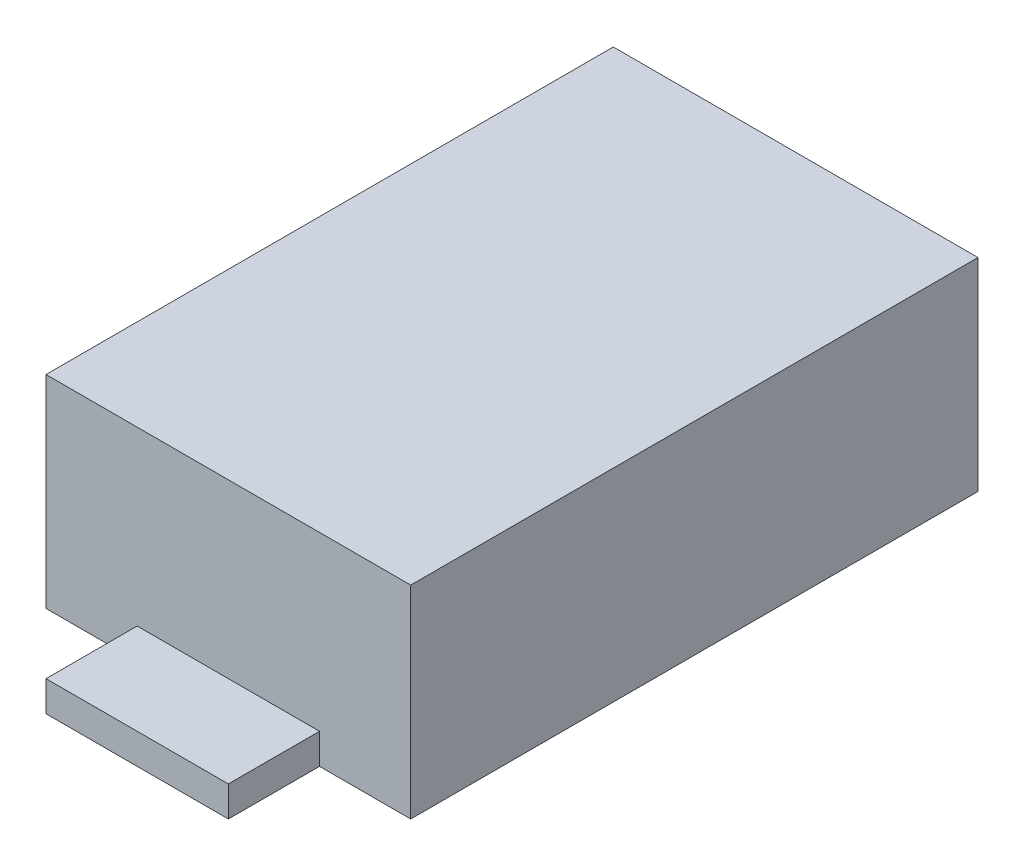
ISO-10303-21;
HEADER;
FILE_DESCRIPTION(('STEP AP214'),'2;1');
FILE_NAME('part.step','',(''),(''),'','','');
FILE_SCHEMA(('AUTOMOTIVE_DESIGN { 1 0 10303 214 1 1 1 1 }'));
ENDSEC;
DATA;
#1=APPLICATION_CONTEXT('core data for automotive mechanical design processes');
#2=APPLICATION_PROTOCOL_DEFINITION('international standard','automotive_design',2000,#1);
#3=PRODUCT_CONTEXT('',#1,'mechanical');
#4=PRODUCT('Part','Part','',(#3));
#5=PRODUCT_RELATED_PRODUCT_CATEGORY('part','',(#4));
#6=PRODUCT_DEFINITION_FORMATION('','',#4);
#7=PRODUCT_DEFINITION_CONTEXT('part definition',#1,'design');
#8=PRODUCT_DEFINITION('design','',#6,#7);
#9=PRODUCT_DEFINITION_SHAPE('','',#8);
#10=(LENGTH_UNIT() NAMED_UNIT(*) SI_UNIT(.MILLI.,.METRE.));
#11=(NAMED_UNIT(*) PLANE_ANGLE_UNIT() SI_UNIT($,.RADIAN.));
#12=(NAMED_UNIT(*) SI_UNIT($,.STERADIAN.) SOLID_ANGLE_UNIT());
#13=UNCERTAINTY_MEASURE_WITH_UNIT(LENGTH_MEASURE(1.E-05),#10,'distance_accuracy_value','');
#14=(GEOMETRIC_REPRESENTATION_CONTEXT(3) GLOBAL_UNCERTAINTY_ASSIGNED_CONTEXT((#13)) GLOBAL_UNIT_ASSIGNED_CONTEXT((#10,
#11,#12)) REPRESENTATION_CONTEXT('',''));
#15=CARTESIAN_POINT('',(0.,0.,0.));
#16=DIRECTION('',(0.,0.,1.));
#17=DIRECTION('',(1.,0.,0.));
#18=AXIS2_PLACEMENT_3D('',#15,#16,#17);
#19=CARTESIAN_POINT('',(-0.9,1.,1.4));
#20=DIRECTION('',(0.,0.,-1.));
#21=DIRECTION('',(-1.,0.,0.));
#22=AXIS2_PLACEMENT_3D('',#19,#20,#21);
#23=PLANE('',#22);
#24=DIRECTION('',(0.,-1.,0.));
#25=VECTOR('',#24,1.);
#26=CARTESIAN_POINT('',(-0.45,0.15,1.4));
#27=LINE('',#26,#25);
#28=CARTESIAN_POINT('',(-0.45,0.15,1.4));
#29=VERTEX_POINT('',#28);
#30=CARTESIAN_POINT('',(-0.45,0.,1.4));
#31=VERTEX_POINT('',#30);
#32=EDGE_CURVE('E154',#29,#31,#27,.T.);
#33=ORIENTED_EDGE('',*,*,#32,.F.);
#34=DIRECTION('',(1.,0.,0.));
#35=VECTOR('',#34,1.);
#36=CARTESIAN_POINT('',(-0.45,0.15,1.4));
#37=LINE('',#36,#35);
#38=CARTESIAN_POINT('',(0.45,0.15,1.4));
#39=VERTEX_POINT('',#38);
#40=EDGE_CURVE('E145',#29,#39,#37,.T.);
#41=ORIENTED_EDGE('',*,*,#40,.T.);
#42=DIRECTION('',(0.,-1.,0.));
#43=VECTOR('',#42,1.);
#44=CARTESIAN_POINT('',(0.45,0.15,1.4));
#45=LINE('',#44,#43);
#46=CARTESIAN_POINT('',(0.45,0.,1.4));
#47=VERTEX_POINT('',#46);
#48=EDGE_CURVE('E160',#39,#47,#45,.T.);
#49=ORIENTED_EDGE('',*,*,#48,.T.);
#50=DIRECTION('',(1.,0.,0.));
#51=VECTOR('',#50,1.);
#52=CARTESIAN_POINT('',(-0.9,0.,1.4));
#53=LINE('',#52,#51);
#54=CARTESIAN_POINT('',(0.9,0.,1.4));
#55=VERTEX_POINT('',#54);
#56=EDGE_CURVE('E205',#47,#55,#53,.T.);
#57=ORIENTED_EDGE('',*,*,#56,.T.);
#58=DIRECTION('',(0.,-1.,0.));
#59=VECTOR('',#58,1.);
#60=CARTESIAN_POINT('',(0.9,1.,1.4));
#61=LINE('',#60,#59);
#62=CARTESIAN_POINT('',(0.9,1.,1.4));
#63=VERTEX_POINT('',#62);
#64=EDGE_CURVE('E196',#63,#55,#61,.T.);
#65=ORIENTED_EDGE('',*,*,#64,.F.);
#66=DIRECTION('',(1.,0.,0.));
#67=VECTOR('',#66,1.);
#68=CARTESIAN_POINT('',(-0.9,1.,1.4));
#69=LINE('',#68,#67);
#70=CARTESIAN_POINT('',(-0.9,1.,1.4));
#71=VERTEX_POINT('',#70);
#72=EDGE_CURVE('E194',#71,#63,#69,.T.);
#73=ORIENTED_EDGE('',*,*,#72,.F.);
#74=DIRECTION('',(0.,-1.,0.));
#75=VECTOR('',#74,1.);
#76=CARTESIAN_POINT('',(-0.9,1.,1.4));
#77=LINE('',#76,#75);
#78=CARTESIAN_POINT('',(-0.9,0.,1.4));
#79=VERTEX_POINT('',#78);
#80=EDGE_CURVE('E210',#71,#79,#77,.T.);
#81=ORIENTED_EDGE('',*,*,#80,.T.);
#82=EDGE_CURVE('E190',#79,#31,#53,.T.);
#83=ORIENTED_EDGE('',*,*,#82,.T.);
#84=EDGE_LOOP('',(#33,#41,#49,#57,#65,#73,#81,#83));
#85=FACE_BOUND('',#84,.T.);
#86=ADVANCED_FACE('F35',(#85),#23,.F.);
#87=CARTESIAN_POINT('',(-0.9,1.,-1.4));
#88=DIRECTION('',(0.,0.,1.));
#89=DIRECTION('',(1.,0.,0.));
#90=AXIS2_PLACEMENT_3D('',#87,#88,#89);
#91=PLANE('',#90);
#92=DIRECTION('',(0.,-1.,0.));
#93=VECTOR('',#92,1.);
#94=CARTESIAN_POINT('',(0.45,0.15,-1.4));
#95=LINE('',#94,#93);
#96=CARTESIAN_POINT('',(0.45,0.15,-1.4));
#97=VERTEX_POINT('',#96);
#98=CARTESIAN_POINT('',(0.45,0.,-1.4));
#99=VERTEX_POINT('',#98);
#100=EDGE_CURVE('E181',#97,#99,#95,.T.);
#101=ORIENTED_EDGE('',*,*,#100,.F.);
#102=DIRECTION('',(1.,0.,0.));
#103=VECTOR('',#102,1.);
#104=CARTESIAN_POINT('',(-0.45,0.15,-1.4));
#105=LINE('',#104,#103);
#106=CARTESIAN_POINT('',(-0.45,0.15,-1.4));
#107=VERTEX_POINT('',#106);
#108=EDGE_CURVE('E165',#107,#97,#105,.T.);
#109=ORIENTED_EDGE('',*,*,#108,.F.);
#110=DIRECTION('',(0.,-1.,0.));
#111=VECTOR('',#110,1.);
#112=CARTESIAN_POINT('',(-0.45,0.15,-1.4));
#113=LINE('',#112,#111);
#114=CARTESIAN_POINT('',(-0.45,0.,-1.4));
#115=VERTEX_POINT('',#114);
#116=EDGE_CURVE('E183',#107,#115,#113,.T.);
#117=ORIENTED_EDGE('',*,*,#116,.T.);
#118=DIRECTION('',(-1.,0.,0.));
#119=VECTOR('',#118,1.);
#120=CARTESIAN_POINT('',(-0.9,0.,-1.4));
#121=LINE('',#120,#119);
#122=CARTESIAN_POINT('',(-0.9,0.,-1.4));
#123=VERTEX_POINT('',#122);
#124=EDGE_CURVE('E199',#115,#123,#121,.T.);
#125=ORIENTED_EDGE('',*,*,#124,.T.);
#126=DIRECTION('',(0.,-1.,0.));
#127=VECTOR('',#126,1.);
#128=CARTESIAN_POINT('',(-0.9,1.,-1.4));
#129=LINE('',#128,#127);
#130=CARTESIAN_POINT('',(-0.9,1.,-1.4));
#131=VERTEX_POINT('',#130);
#132=EDGE_CURVE('E43',#131,#123,#129,.T.);
#133=ORIENTED_EDGE('',*,*,#132,.F.);
#134=DIRECTION('',(-1.,0.,0.));
#135=VECTOR('',#134,1.);
#136=CARTESIAN_POINT('',(-0.9,1.,-1.4));
#137=LINE('',#136,#135);
#138=CARTESIAN_POINT('',(0.9,1.,-1.4));
#139=VERTEX_POINT('',#138);
#140=EDGE_CURVE('E189',#139,#131,#137,.T.);
#141=ORIENTED_EDGE('',*,*,#140,.F.);
#142=DIRECTION('',(0.,-1.,0.));
#143=VECTOR('',#142,1.);
#144=CARTESIAN_POINT('',(0.9,1.,-1.4));
#145=LINE('',#144,#143);
#146=CARTESIAN_POINT('',(0.9,0.,-1.4));
#147=VERTEX_POINT('',#146);
#148=EDGE_CURVE('E11',#139,#147,#145,.T.);
#149=ORIENTED_EDGE('',*,*,#148,.T.);
#150=EDGE_CURVE('E200',#147,#99,#121,.T.);
#151=ORIENTED_EDGE('',*,*,#150,.T.);
#152=EDGE_LOOP('',(#101,#109,#117,#125,#133,#141,#149,#151));
#153=FACE_BOUND('',#152,.T.);
#154=ADVANCED_FACE('F233',(#153),#91,.F.);
#155=CARTESIAN_POINT('',(0.9,1.,-1.4));
#156=DIRECTION('',(-1.,0.,0.));
#157=DIRECTION('',(0.,0.,1.));
#158=AXIS2_PLACEMENT_3D('',#155,#156,#157);
#159=PLANE('',#158);
#160=DIRECTION('',(0.,0.,-1.));
#161=VECTOR('',#160,1.);
#162=CARTESIAN_POINT('',(0.9,0.,-1.4));
#163=LINE('',#162,#161);
#164=EDGE_CURVE('E185',#55,#147,#163,.T.);
#165=ORIENTED_EDGE('',*,*,#164,.T.);
#166=ORIENTED_EDGE('',*,*,#148,.F.);
#167=DIRECTION('',(0.,0.,-1.));
#168=VECTOR('',#167,1.);
#169=CARTESIAN_POINT('',(0.9,1.,-1.4));
#170=LINE('',#169,#168);
#171=EDGE_CURVE('E186',#63,#139,#170,.T.);
#172=ORIENTED_EDGE('',*,*,#171,.F.);
#173=ORIENTED_EDGE('',*,*,#64,.T.);
#174=EDGE_LOOP('',(#165,#166,#172,#173));
#175=FACE_BOUND('',#174,.T.);
#176=ADVANCED_FACE('F37',(#175),#159,.F.);
#177=CARTESIAN_POINT('',(-0.9,1.,-1.4));
#178=DIRECTION('',(1.,0.,0.));
#179=DIRECTION('',(0.,0.,-1.));
#180=AXIS2_PLACEMENT_3D('',#177,#178,#179);
#181=PLANE('',#180);
#182=DIRECTION('',(0.,0.,1.));
#183=VECTOR('',#182,1.);
#184=CARTESIAN_POINT('',(-0.9,0.,-1.4));
#185=LINE('',#184,#183);
#186=EDGE_CURVE('E203',#123,#79,#185,.T.);
#187=ORIENTED_EDGE('',*,*,#186,.T.);
#188=ORIENTED_EDGE('',*,*,#80,.F.);
#189=DIRECTION('',(0.,0.,1.));
#190=VECTOR('',#189,1.);
#191=CARTESIAN_POINT('',(-0.9,1.,-1.4));
#192=LINE('',#191,#190);
#193=EDGE_CURVE('E192',#131,#71,#192,.T.);
#194=ORIENTED_EDGE('',*,*,#193,.F.);
#195=ORIENTED_EDGE('',*,*,#132,.T.);
#196=EDGE_LOOP('',(#187,#188,#194,#195));
#197=FACE_BOUND('',#196,.T.);
#198=ADVANCED_FACE('F217',(#197),#181,.F.);
#199=CARTESIAN_POINT('',(0.,1.,0.));
#200=DIRECTION('',(0.,1.,0.));
#201=DIRECTION('',(0.,0.,1.));
#202=AXIS2_PLACEMENT_3D('',#199,#200,#201);
#203=PLANE('',#202);
#204=ORIENTED_EDGE('',*,*,#171,.T.);
#205=ORIENTED_EDGE('',*,*,#140,.T.);
#206=ORIENTED_EDGE('',*,*,#193,.T.);
#207=ORIENTED_EDGE('',*,*,#72,.T.);
#208=EDGE_LOOP('',(#204,#205,#206,#207));
#209=FACE_BOUND('',#208,.T.);
#210=ADVANCED_FACE('F230',(#209),#203,.T.);
#211=CARTESIAN_POINT('',(0.,0.,0.));
#212=DIRECTION('',(0.,1.,0.));
#213=DIRECTION('',(0.,0.,1.));
#214=AXIS2_PLACEMENT_3D('',#211,#212,#213);
#215=PLANE('',#214);
#216=ORIENTED_EDGE('',*,*,#164,.F.);
#217=ORIENTED_EDGE('',*,*,#56,.F.);
#218=DIRECTION('',(0.,0.,1.));
#219=VECTOR('',#218,1.);
#220=CARTESIAN_POINT('',(0.45,0.,1.4));
#221=LINE('',#220,#219);
#222=CARTESIAN_POINT('',(0.45,0.,1.85));
#223=VERTEX_POINT('',#222);
#224=EDGE_CURVE('E50',#47,#223,#221,.T.);
#225=ORIENTED_EDGE('',*,*,#224,.T.);
#226=DIRECTION('',(-1.,0.,0.));
#227=VECTOR('',#226,1.);
#228=CARTESIAN_POINT('',(-0.45,0.,1.85));
#229=LINE('',#228,#227);
#230=CARTESIAN_POINT('',(-0.45,0.,1.85));
#231=VERTEX_POINT('',#230);
#232=EDGE_CURVE('E156',#223,#231,#229,.T.);
#233=ORIENTED_EDGE('',*,*,#232,.T.);
#234=DIRECTION('',(0.,0.,-1.));
#235=VECTOR('',#234,1.);
#236=CARTESIAN_POINT('',(-0.45,0.,1.4));
#237=LINE('',#236,#235);
#238=EDGE_CURVE('E131',#231,#31,#237,.T.);
#239=ORIENTED_EDGE('',*,*,#238,.T.);
#240=ORIENTED_EDGE('',*,*,#82,.F.);
#241=ORIENTED_EDGE('',*,*,#186,.F.);
#242=ORIENTED_EDGE('',*,*,#124,.F.);
#243=DIRECTION('',(0.,0.,1.));
#244=VECTOR('',#243,1.);
#245=CARTESIAN_POINT('',(-0.45,0.,-1.4));
#246=LINE('',#245,#244);
#247=CARTESIAN_POINT('',(-0.45,0.,-1.85));
#248=VERTEX_POINT('',#247);
#249=EDGE_CURVE('E58',#248,#115,#246,.T.);
#250=ORIENTED_EDGE('',*,*,#249,.F.);
#251=DIRECTION('',(-1.,0.,0.));
#252=VECTOR('',#251,1.);
#253=CARTESIAN_POINT('',(-0.45,0.,-1.85));
#254=LINE('',#253,#252);
#255=CARTESIAN_POINT('',(0.45,0.,-1.85));
#256=VERTEX_POINT('',#255);
#257=EDGE_CURVE('E166',#256,#248,#254,.T.);
#258=ORIENTED_EDGE('',*,*,#257,.F.);
#259=DIRECTION('',(0.,0.,-1.));
#260=VECTOR('',#259,1.);
#261=CARTESIAN_POINT('',(0.45,0.,-1.4));
#262=LINE('',#261,#260);
#263=EDGE_CURVE('E174',#99,#256,#262,.T.);
#264=ORIENTED_EDGE('',*,*,#263,.F.);
#265=ORIENTED_EDGE('',*,*,#150,.F.);
#266=EDGE_LOOP('',(#216,#217,#225,#233,#239,#240,#241,#242,#250,#258,#264,#265));
#267=FACE_BOUND('',#266,.T.);
#268=ADVANCED_FACE('F224',(#267),#215,.F.);
#269=CARTESIAN_POINT('',(-0.45,0.15,-1.4));
#270=DIRECTION('',(1.,0.,0.));
#271=DIRECTION('',(0.,0.,-1.));
#272=AXIS2_PLACEMENT_3D('',#269,#270,#271);
#273=PLANE('',#272);
#274=ORIENTED_EDGE('',*,*,#249,.T.);
#275=ORIENTED_EDGE('',*,*,#116,.F.);
#276=DIRECTION('',(0.,0.,1.));
#277=VECTOR('',#276,1.);
#278=CARTESIAN_POINT('',(-0.45,0.15,-1.4));
#279=LINE('',#278,#277);
#280=CARTESIAN_POINT('',(-0.45,0.15,-1.85));
#281=VERTEX_POINT('',#280);
#282=EDGE_CURVE('E163',#281,#107,#279,.T.);
#283=ORIENTED_EDGE('',*,*,#282,.F.);
#284=DIRECTION('',(0.,-1.,0.));
#285=VECTOR('',#284,1.);
#286=CARTESIAN_POINT('',(-0.45,0.15,-1.85));
#287=LINE('',#286,#285);
#288=EDGE_CURVE('E172',#281,#248,#287,.T.);
#289=ORIENTED_EDGE('',*,*,#288,.T.);
#290=EDGE_LOOP('',(#274,#275,#283,#289));
#291=FACE_BOUND('',#290,.T.);
#292=ADVANCED_FACE('F250',(#291),#273,.F.);
#293=CARTESIAN_POINT('',(0.45,0.15,-1.4));
#294=DIRECTION('',(-1.,0.,0.));
#295=DIRECTION('',(0.,0.,1.));
#296=AXIS2_PLACEMENT_3D('',#293,#294,#295);
#297=PLANE('',#296);
#298=ORIENTED_EDGE('',*,*,#263,.T.);
#299=DIRECTION('',(0.,-1.,0.));
#300=VECTOR('',#299,1.);
#301=CARTESIAN_POINT('',(0.45,0.15,-1.85));
#302=LINE('',#301,#300);
#303=CARTESIAN_POINT('',(0.45,0.15,-1.85));
#304=VERTEX_POINT('',#303);
#305=EDGE_CURVE('E178',#304,#256,#302,.T.);
#306=ORIENTED_EDGE('',*,*,#305,.F.);
#307=DIRECTION('',(0.,0.,-1.));
#308=VECTOR('',#307,1.);
#309=CARTESIAN_POINT('',(0.45,0.15,-1.4));
#310=LINE('',#309,#308);
#311=EDGE_CURVE('E168',#97,#304,#310,.T.);
#312=ORIENTED_EDGE('',*,*,#311,.F.);
#313=ORIENTED_EDGE('',*,*,#100,.T.);
#314=EDGE_LOOP('',(#298,#306,#312,#313));
#315=FACE_BOUND('',#314,.T.);
#316=ADVANCED_FACE('F240',(#315),#297,.F.);
#317=CARTESIAN_POINT('',(-0.45,0.15,-1.85));
#318=DIRECTION('',(0.,0.,1.));
#319=DIRECTION('',(1.,0.,0.));
#320=AXIS2_PLACEMENT_3D('',#317,#318,#319);
#321=PLANE('',#320);
#322=ORIENTED_EDGE('',*,*,#257,.T.);
#323=ORIENTED_EDGE('',*,*,#288,.F.);
#324=DIRECTION('',(-1.,0.,0.));
#325=VECTOR('',#324,1.);
#326=CARTESIAN_POINT('',(-0.45,0.15,-1.85));
#327=LINE('',#326,#325);
#328=EDGE_CURVE('E170',#304,#281,#327,.T.);
#329=ORIENTED_EDGE('',*,*,#328,.F.);
#330=ORIENTED_EDGE('',*,*,#305,.T.);
#331=EDGE_LOOP('',(#322,#323,#329,#330));
#332=FACE_BOUND('',#331,.T.);
#333=ADVANCED_FACE('F244',(#332),#321,.F.);
#334=CARTESIAN_POINT('',(0.,0.15,0.));
#335=DIRECTION('',(0.,-1.,0.));
#336=DIRECTION('',(0.,0.,-1.));
#337=AXIS2_PLACEMENT_3D('',#334,#335,#336);
#338=PLANE('',#337);
#339=ORIENTED_EDGE('',*,*,#282,.T.);
#340=ORIENTED_EDGE('',*,*,#108,.T.);
#341=ORIENTED_EDGE('',*,*,#311,.T.);
#342=ORIENTED_EDGE('',*,*,#328,.T.);
#343=EDGE_LOOP('',(#339,#340,#341,#342));
#344=FACE_BOUND('',#343,.T.);
#345=ADVANCED_FACE('F248',(#344),#338,.F.);
#346=CARTESIAN_POINT('',(-0.45,0.15,1.4));
#347=DIRECTION('',(-1.,0.,0.));
#348=DIRECTION('',(0.,0.,1.));
#349=AXIS2_PLACEMENT_3D('',#346,#347,#348);
#350=PLANE('',#349);
#351=ORIENTED_EDGE('',*,*,#238,.F.);
#352=DIRECTION('',(0.,-1.,0.));
#353=VECTOR('',#352,1.);
#354=CARTESIAN_POINT('',(-0.45,0.15,1.85));
#355=LINE('',#354,#353);
#356=CARTESIAN_POINT('',(-0.45,0.15,1.85));
#357=VERTEX_POINT('',#356);
#358=EDGE_CURVE('E125',#357,#231,#355,.T.);
#359=ORIENTED_EDGE('',*,*,#358,.F.);
#360=DIRECTION('',(0.,0.,-1.));
#361=VECTOR('',#360,1.);
#362=CARTESIAN_POINT('',(-0.45,0.15,1.4));
#363=LINE('',#362,#361);
#364=EDGE_CURVE('E128',#357,#29,#363,.T.);
#365=ORIENTED_EDGE('',*,*,#364,.T.);
#366=ORIENTED_EDGE('',*,*,#32,.T.);
#367=EDGE_LOOP('',(#351,#359,#365,#366));
#368=FACE_BOUND('',#367,.T.);
#369=ADVANCED_FACE('F127',(#368),#350,.T.);
#370=CARTESIAN_POINT('',(-0.45,0.15,1.85));
#371=DIRECTION('',(0.,0.,1.));
#372=DIRECTION('',(1.,0.,0.));
#373=AXIS2_PLACEMENT_3D('',#370,#371,#372);
#374=PLANE('',#373);
#375=ORIENTED_EDGE('',*,*,#232,.F.);
#376=DIRECTION('',(0.,-1.,0.));
#377=VECTOR('',#376,1.);
#378=CARTESIAN_POINT('',(0.45,0.15,1.85));
#379=LINE('',#378,#377);
#380=CARTESIAN_POINT('',(0.45,0.15,1.85));
#381=VERTEX_POINT('',#380);
#382=EDGE_CURVE('E136',#381,#223,#379,.T.);
#383=ORIENTED_EDGE('',*,*,#382,.F.);
#384=DIRECTION('',(-1.,0.,0.));
#385=VECTOR('',#384,1.);
#386=CARTESIAN_POINT('',(-0.45,0.15,1.85));
#387=LINE('',#386,#385);
#388=EDGE_CURVE('E142',#381,#357,#387,.T.);
#389=ORIENTED_EDGE('',*,*,#388,.T.);
#390=ORIENTED_EDGE('',*,*,#358,.T.);
#391=EDGE_LOOP('',(#375,#383,#389,#390));
#392=FACE_BOUND('',#391,.T.);
#393=ADVANCED_FACE('F148',(#392),#374,.T.);
#394=CARTESIAN_POINT('',(0.45,0.15,1.4));
#395=DIRECTION('',(1.,0.,0.));
#396=DIRECTION('',(0.,0.,-1.));
#397=AXIS2_PLACEMENT_3D('',#394,#395,#396);
#398=PLANE('',#397);
#399=ORIENTED_EDGE('',*,*,#224,.F.);
#400=ORIENTED_EDGE('',*,*,#48,.F.);
#401=DIRECTION('',(0.,0.,1.));
#402=VECTOR('',#401,1.);
#403=CARTESIAN_POINT('',(0.45,0.15,1.4));
#404=LINE('',#403,#402);
#405=EDGE_CURVE('E149',#39,#381,#404,.T.);
#406=ORIENTED_EDGE('',*,*,#405,.T.);
#407=ORIENTED_EDGE('',*,*,#382,.T.);
#408=EDGE_LOOP('',(#399,#400,#406,#407));
#409=FACE_BOUND('',#408,.T.);
#410=ADVANCED_FACE('F339',(#409),#398,.T.);
#411=CARTESIAN_POINT('',(0.,0.15,0.));
#412=DIRECTION('',(0.,-1.,0.));
#413=DIRECTION('',(0.,0.,1.));
#414=AXIS2_PLACEMENT_3D('',#411,#412,#413);
#415=PLANE('',#414);
#416=ORIENTED_EDGE('',*,*,#364,.F.);
#417=ORIENTED_EDGE('',*,*,#388,.F.);
#418=ORIENTED_EDGE('',*,*,#405,.F.);
#419=ORIENTED_EDGE('',*,*,#40,.F.);
#420=EDGE_LOOP('',(#416,#417,#418,#419));
#421=FACE_BOUND('',#420,.T.);
#422=ADVANCED_FACE('F140',(#421),#415,.F.);
#423=CLOSED_SHELL('',(#86,#154,#176,#198,#210,#268,#292,#316,#333,#345,#369,#393,#410,#422));
#424=MANIFOLD_SOLID_BREP('B2',#423);
#425=ADVANCED_BREP_SHAPE_REPRESENTATION('',(#18,#424),#14);
#426=SHAPE_DEFINITION_REPRESENTATION(#9,#425);
ENDSEC;
END-ISO-10303-21;
